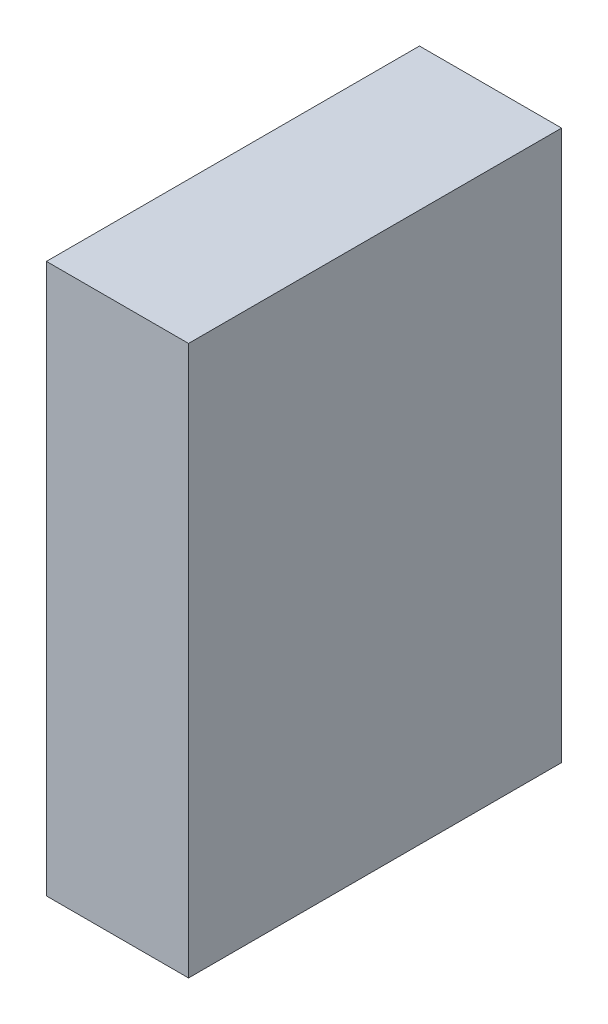
ISO-10303-21;
HEADER;
FILE_DESCRIPTION(('STEP AP214'),'2;1');
FILE_NAME('part.step','',(''),(''),'','','');
FILE_SCHEMA(('AUTOMOTIVE_DESIGN { 1 0 10303 214 1 1 1 1 }'));
ENDSEC;
DATA;
#1=APPLICATION_CONTEXT('core data for automotive mechanical design processes');
#2=APPLICATION_PROTOCOL_DEFINITION('international standard','automotive_design',2000,#1);
#3=PRODUCT_CONTEXT('',#1,'mechanical');
#4=PRODUCT('Part','Part','',(#3));
#5=PRODUCT_RELATED_PRODUCT_CATEGORY('part','',(#4));
#6=PRODUCT_DEFINITION_FORMATION('','',#4);
#7=PRODUCT_DEFINITION_CONTEXT('part definition',#1,'design');
#8=PRODUCT_DEFINITION('design','',#6,#7);
#9=PRODUCT_DEFINITION_SHAPE('','',#8);
#10=(LENGTH_UNIT() NAMED_UNIT(*) SI_UNIT(.MILLI.,.METRE.));
#11=(NAMED_UNIT(*) PLANE_ANGLE_UNIT() SI_UNIT($,.RADIAN.));
#12=(NAMED_UNIT(*) SI_UNIT($,.STERADIAN.) SOLID_ANGLE_UNIT());
#13=UNCERTAINTY_MEASURE_WITH_UNIT(LENGTH_MEASURE(1.E-05),#10,'distance_accuracy_value','');
#14=(GEOMETRIC_REPRESENTATION_CONTEXT(3) GLOBAL_UNCERTAINTY_ASSIGNED_CONTEXT((#13)) GLOBAL_UNIT_ASSIGNED_CONTEXT((#10,
#11,#12)) REPRESENTATION_CONTEXT('',''));
#15=CARTESIAN_POINT('',(0.,0.,0.));
#16=DIRECTION('',(0.,0.,1.));
#17=DIRECTION('',(1.,0.,0.));
#18=AXIS2_PLACEMENT_3D('',#15,#16,#17);
#19=CARTESIAN_POINT('',(0.,0.,1.00000054));
#20=DIRECTION('',(0.,0.,1.));
#21=DIRECTION('',(1.,0.,0.));
#22=AXIS2_PLACEMENT_3D('',#19,#20,#21);
#23=PLANE('',#22);
#24=DIRECTION('',(0.,-1.,0.));
#25=VECTOR('',#24,1.);
#26=CARTESIAN_POINT('',(-0.1905,0.7366,1.00000054));
#27=LINE('',#26,#25);
#28=CARTESIAN_POINT('',(-0.1905,0.7366,1.00000054));
#29=VERTEX_POINT('',#28);
#30=CARTESIAN_POINT('',(-0.1905,-0.7366,1.00000054));
#31=VERTEX_POINT('',#30);
#32=EDGE_CURVE('E82',#29,#31,#27,.T.);
#33=ORIENTED_EDGE('',*,*,#32,.T.);
#34=DIRECTION('',(1.,0.,0.));
#35=VECTOR('',#34,1.);
#36=CARTESIAN_POINT('',(-0.1905,-0.7366,1.00000054));
#37=LINE('',#36,#35);
#38=CARTESIAN_POINT('',(0.1905,-0.7366,1.00000054));
#39=VERTEX_POINT('',#38);
#40=EDGE_CURVE('E80',#31,#39,#37,.T.);
#41=ORIENTED_EDGE('',*,*,#40,.T.);
#42=DIRECTION('',(0.,1.,0.));
#43=VECTOR('',#42,1.);
#44=CARTESIAN_POINT('',(0.1905,-0.7366,1.00000054));
#45=LINE('',#44,#43);
#46=CARTESIAN_POINT('',(0.1905,0.7366,1.00000054));
#47=VERTEX_POINT('',#46);
#48=EDGE_CURVE('E70',#39,#47,#45,.T.);
#49=ORIENTED_EDGE('',*,*,#48,.T.);
#50=DIRECTION('',(-1.,0.,0.));
#51=VECTOR('',#50,1.);
#52=CARTESIAN_POINT('',(0.1905,0.7366,1.00000054));
#53=LINE('',#52,#51);
#54=EDGE_CURVE('E11',#47,#29,#53,.T.);
#55=ORIENTED_EDGE('',*,*,#54,.T.);
#56=EDGE_LOOP('',(#33,#41,#49,#55));
#57=FACE_BOUND('',#56,.T.);
#58=ADVANCED_FACE('F17',(#57),#23,.T.);
#59=CARTESIAN_POINT('',(0.,0.,0.));
#60=DIRECTION('',(0.,0.,1.));
#61=DIRECTION('',(1.,0.,0.));
#62=AXIS2_PLACEMENT_3D('',#59,#60,#61);
#63=PLANE('',#62);
#64=DIRECTION('',(-1.,0.,0.));
#65=VECTOR('',#64,1.);
#66=CARTESIAN_POINT('',(0.1905,0.7366,0.));
#67=LINE('',#66,#65);
#68=CARTESIAN_POINT('',(0.1905,0.7366,0.));
#69=VERTEX_POINT('',#68);
#70=CARTESIAN_POINT('',(-0.1905,0.7366,0.));
#71=VERTEX_POINT('',#70);
#72=EDGE_CURVE('E26',#69,#71,#67,.T.);
#73=ORIENTED_EDGE('',*,*,#72,.F.);
#74=DIRECTION('',(0.,1.,0.));
#75=VECTOR('',#74,1.);
#76=CARTESIAN_POINT('',(0.1905,-0.7366,0.));
#77=LINE('',#76,#75);
#78=CARTESIAN_POINT('',(0.1905,-0.7366,0.));
#79=VERTEX_POINT('',#78);
#80=EDGE_CURVE('E62',#79,#69,#77,.T.);
#81=ORIENTED_EDGE('',*,*,#80,.F.);
#82=DIRECTION('',(1.,0.,0.));
#83=VECTOR('',#82,1.);
#84=CARTESIAN_POINT('',(-0.1905,-0.7366,0.));
#85=LINE('',#84,#83);
#86=CARTESIAN_POINT('',(-0.1905,-0.7366,0.));
#87=VERTEX_POINT('',#86);
#88=EDGE_CURVE('E89',#87,#79,#85,.T.);
#89=ORIENTED_EDGE('',*,*,#88,.F.);
#90=DIRECTION('',(0.,-1.,0.));
#91=VECTOR('',#90,1.);
#92=CARTESIAN_POINT('',(-0.1905,0.7366,0.));
#93=LINE('',#92,#91);
#94=EDGE_CURVE('E164',#71,#87,#93,.T.);
#95=ORIENTED_EDGE('',*,*,#94,.F.);
#96=EDGE_LOOP('',(#73,#81,#89,#95));
#97=FACE_BOUND('',#96,.T.);
#98=ADVANCED_FACE('F131',(#97),#63,.F.);
#99=CARTESIAN_POINT('',(0.1905,0.7366,0.));
#100=DIRECTION('',(0.,-1.,0.));
#101=DIRECTION('',(0.,0.,-1.));
#102=AXIS2_PLACEMENT_3D('',#99,#100,#101);
#103=PLANE('',#102);
#104=ORIENTED_EDGE('',*,*,#72,.T.);
#105=DIRECTION('',(0.,0.,1.));
#106=VECTOR('',#105,1.);
#107=CARTESIAN_POINT('',(-0.1905,0.7366,0.));
#108=LINE('',#107,#106);
#109=EDGE_CURVE('E94',#71,#29,#108,.T.);
#110=ORIENTED_EDGE('',*,*,#109,.T.);
#111=ORIENTED_EDGE('',*,*,#54,.F.);
#112=DIRECTION('',(0.,0.,1.));
#113=VECTOR('',#112,1.);
#114=CARTESIAN_POINT('',(0.1905,0.7366,0.));
#115=LINE('',#114,#113);
#116=EDGE_CURVE('E76',#69,#47,#115,.T.);
#117=ORIENTED_EDGE('',*,*,#116,.F.);
#118=EDGE_LOOP('',(#104,#110,#111,#117));
#119=FACE_BOUND('',#118,.T.);
#120=ADVANCED_FACE('F126',(#119),#103,.F.);
#121=CARTESIAN_POINT('',(0.1905,-0.7366,0.));
#122=DIRECTION('',(-1.,0.,0.));
#123=DIRECTION('',(0.,0.,1.));
#124=AXIS2_PLACEMENT_3D('',#121,#122,#123);
#125=PLANE('',#124);
#126=ORIENTED_EDGE('',*,*,#80,.T.);
#127=ORIENTED_EDGE('',*,*,#116,.T.);
#128=ORIENTED_EDGE('',*,*,#48,.F.);
#129=DIRECTION('',(0.,0.,1.));
#130=VECTOR('',#129,1.);
#131=CARTESIAN_POINT('',(0.1905,-0.7366,0.));
#132=LINE('',#131,#130);
#133=EDGE_CURVE('E74',#79,#39,#132,.T.);
#134=ORIENTED_EDGE('',*,*,#133,.F.);
#135=EDGE_LOOP('',(#126,#127,#128,#134));
#136=FACE_BOUND('',#135,.T.);
#137=ADVANCED_FACE('F72',(#136),#125,.F.);
#138=CARTESIAN_POINT('',(-0.1905,-0.7366,0.));
#139=DIRECTION('',(0.,1.,0.));
#140=DIRECTION('',(1.,0.,0.));
#141=AXIS2_PLACEMENT_3D('',#138,#139,#140);
#142=PLANE('',#141);
#143=ORIENTED_EDGE('',*,*,#88,.T.);
#144=ORIENTED_EDGE('',*,*,#133,.T.);
#145=ORIENTED_EDGE('',*,*,#40,.F.);
#146=DIRECTION('',(0.,0.,1.));
#147=VECTOR('',#146,1.);
#148=CARTESIAN_POINT('',(-0.1905,-0.7366,0.));
#149=LINE('',#148,#147);
#150=EDGE_CURVE('E172',#87,#31,#149,.T.);
#151=ORIENTED_EDGE('',*,*,#150,.F.);
#152=EDGE_LOOP('',(#143,#144,#145,#151));
#153=FACE_BOUND('',#152,.T.);
#154=ADVANCED_FACE('F88',(#153),#142,.F.);
#155=CARTESIAN_POINT('',(-0.1905,0.7366,0.));
#156=DIRECTION('',(1.,0.,0.));
#157=DIRECTION('',(0.,1.,0.));
#158=AXIS2_PLACEMENT_3D('',#155,#156,#157);
#159=PLANE('',#158);
#160=ORIENTED_EDGE('',*,*,#94,.T.);
#161=ORIENTED_EDGE('',*,*,#150,.T.);
#162=ORIENTED_EDGE('',*,*,#32,.F.);
#163=ORIENTED_EDGE('',*,*,#109,.F.);
#164=EDGE_LOOP('',(#160,#161,#162,#163));
#165=FACE_BOUND('',#164,.T.);
#166=ADVANCED_FACE('F108',(#165),#159,.F.);
#167=CLOSED_SHELL('',(#58,#98,#120,#137,#154,#166));
#168=MANIFOLD_SOLID_BREP('B1',#167);
#169=ADVANCED_BREP_SHAPE_REPRESENTATION('',(#18,#168),#14);
#170=SHAPE_DEFINITION_REPRESENTATION(#9,#169);
ENDSEC;
END-ISO-10303-21;
